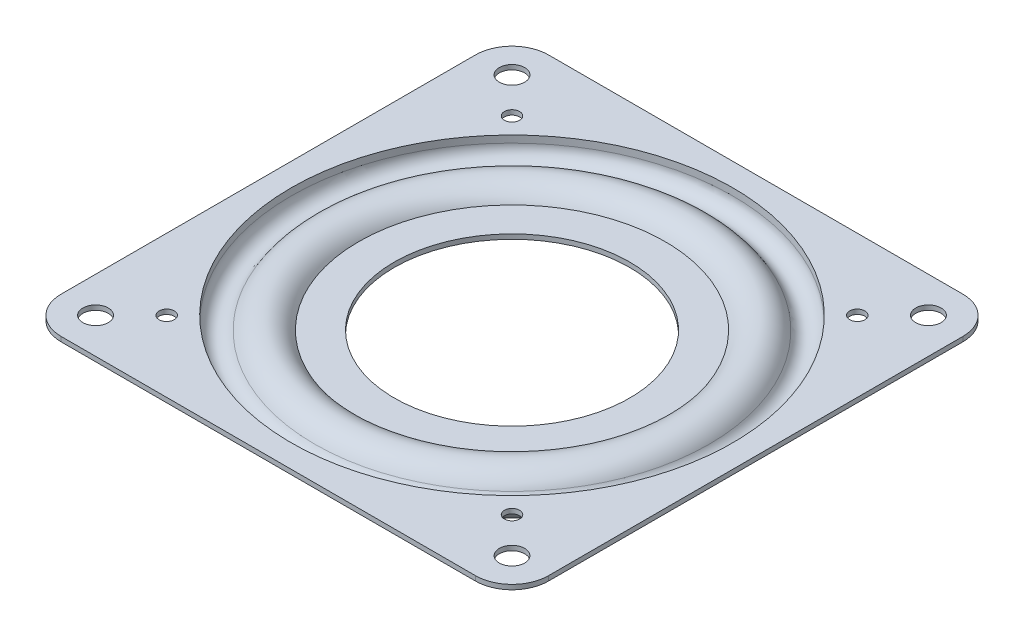
ISO-10303-21;
HEADER;
FILE_DESCRIPTION(('STEP AP214'),'2;1');
FILE_NAME('part.step','',(''),(''),'','','');
FILE_SCHEMA(('AUTOMOTIVE_DESIGN { 1 0 10303 214 1 1 1 1 }'));
ENDSEC;
DATA;
#1=APPLICATION_CONTEXT('core data for automotive mechanical design processes');
#2=APPLICATION_PROTOCOL_DEFINITION('international standard','automotive_design',2000,#1);
#3=PRODUCT_CONTEXT('',#1,'mechanical');
#4=PRODUCT('Part','Part','',(#3));
#5=PRODUCT_RELATED_PRODUCT_CATEGORY('part','',(#4));
#6=PRODUCT_DEFINITION_FORMATION('','',#4);
#7=PRODUCT_DEFINITION_CONTEXT('part definition',#1,'design');
#8=PRODUCT_DEFINITION('design','',#6,#7);
#9=PRODUCT_DEFINITION_SHAPE('','',#8);
#10=(LENGTH_UNIT() NAMED_UNIT(*) SI_UNIT(.MILLI.,.METRE.));
#11=(NAMED_UNIT(*) PLANE_ANGLE_UNIT() SI_UNIT($,.RADIAN.));
#12=(NAMED_UNIT(*) SI_UNIT($,.STERADIAN.) SOLID_ANGLE_UNIT());
#13=UNCERTAINTY_MEASURE_WITH_UNIT(LENGTH_MEASURE(1.E-05),#10,'distance_accuracy_value','');
#14=(GEOMETRIC_REPRESENTATION_CONTEXT(3) GLOBAL_UNCERTAINTY_ASSIGNED_CONTEXT((#13)) GLOBAL_UNIT_ASSIGNED_CONTEXT((#10,
#11,#12)) REPRESENTATION_CONTEXT('',''));
#15=CARTESIAN_POINT('',(0.,0.,0.));
#16=DIRECTION('',(0.,0.,1.));
#17=DIRECTION('',(1.,0.,0.));
#18=AXIS2_PLACEMENT_3D('',#15,#16,#17);
#19=CARTESIAN_POINT('',(26.2598834483685,0.,-7.7105974819143));
#20=DIRECTION('',(0.,1.,0.));
#21=DIRECTION('',(0.959492973614501,0.,-0.281732556841416));
#22=AXIS2_PLACEMENT_3D('',#19,#20,#21);
#23=SPHERICAL_SURFACE('',#22,3.68300000000001);
#24=CARTESIAN_POINT('',(26.2598834483685,3.68300000000001,-7.7105974819143));
#25=VERTEX_POINT('',#24);
#26=VERTEX_LOOP('',#25);
#27=FACE_BOUND('',#26,.T.);
#28=ADVANCED_FACE('F36',(#27),#23,.T.);
#29=CLOSED_SHELL('',(#28));
#30=MANIFOLD_SOLID_BREP('B2',#29);
#31=CARTESIAN_POINT('',(23.0238473132904,0.,-14.7965282125332));
#32=DIRECTION('',(0.,1.,0.));
#33=DIRECTION('',(0.841253532831189,0.,-0.540640817455586));
#34=AXIS2_PLACEMENT_3D('',#31,#32,#33);
#35=SPHERICAL_SURFACE('',#34,3.68300000000001);
#36=CARTESIAN_POINT('',(23.0238473132904,3.68300000000001,-14.7965282125332));
#37=VERTEX_POINT('',#36);
#38=VERTEX_LOOP('',#37);
#39=FACE_BOUND('',#38,.T.);
#40=ADVANCED_FACE('F55',(#39),#35,.T.);
#41=CLOSED_SHELL('',(#40));
#42=MANIFOLD_SOLID_BREP('B6',#41);
#43=CARTESIAN_POINT('',(17.9225559969818,0.,-20.6837322257143));
#44=DIRECTION('',(0.,1.,0.));
#45=DIRECTION('',(0.654860733945295,0.,-0.75574957435425));
#46=AXIS2_PLACEMENT_3D('',#43,#44,#45);
#47=SPHERICAL_SURFACE('',#46,3.68300000000001);
#48=CARTESIAN_POINT('',(17.9225559969818,3.68300000000001,-20.6837322257143));
#49=VERTEX_POINT('',#48);
#50=VERTEX_LOOP('',#49);
#51=FACE_BOUND('',#50,.T.);
#52=ADVANCED_FACE('F74',(#51),#47,.T.);
#53=CLOSED_SHELL('',(#52));
#54=MANIFOLD_SOLID_BREP('B32',#53);
#55=CARTESIAN_POINT('',(11.3692857833424,0.,-24.89526326486));
#56=DIRECTION('',(0.,1.,0.));
#57=DIRECTION('',(0.415415013001897,0.,-0.909631995354513));
#58=AXIS2_PLACEMENT_3D('',#55,#56,#57);
#59=SPHERICAL_SURFACE('',#58,3.68300000000001);
#60=CARTESIAN_POINT('',(11.3692857833424,3.68300000000001,-24.89526326486));
#61=VERTEX_POINT('',#60);
#62=VERTEX_LOOP('',#61);
#63=FACE_BOUND('',#62,.T.);
#64=ADVANCED_FACE('F93',(#63),#59,.T.);
#65=CLOSED_SHELL('',(#64));
#66=MANIFOLD_SOLID_BREP('B51',#65);
#67=CARTESIAN_POINT('',(3.89494365128271,0.,-27.0899281321183));
#68=DIRECTION('',(0.,1.,0.));
#69=DIRECTION('',(0.142314838273296,0.,-0.989821441880931));
#70=AXIS2_PLACEMENT_3D('',#67,#68,#69);
#71=SPHERICAL_SURFACE('',#70,3.68300000000001);
#72=CARTESIAN_POINT('',(3.89494365128271,3.683,-27.0899281321183));
#73=VERTEX_POINT('',#72);
#74=VERTEX_LOOP('',#73);
#75=FACE_BOUND('',#74,.T.);
#76=ADVANCED_FACE('F112',(#75),#71,.T.);
#77=CLOSED_SHELL('',(#76));
#78=MANIFOLD_SOLID_BREP('B70',#77);
#79=CARTESIAN_POINT('',(-3.89494365128212,0.,-27.0899281321183));
#80=DIRECTION('',(0.,1.,0.));
#81=DIRECTION('',(-0.142314838273275,0.,-0.989821441880934));
#82=AXIS2_PLACEMENT_3D('',#79,#80,#81);
#83=SPHERICAL_SURFACE('',#82,3.68300000000001);
#84=CARTESIAN_POINT('',(-3.89494365128212,3.683,-27.0899281321183));
#85=VERTEX_POINT('',#84);
#86=VERTEX_LOOP('',#85);
#87=FACE_BOUND('',#86,.T.);
#88=ADVANCED_FACE('F131',(#87),#83,.T.);
#89=CLOSED_SHELL('',(#88));
#90=MANIFOLD_SOLID_BREP('B89',#89);
#91=CARTESIAN_POINT('',(-11.3692857833419,0.,-24.8952632648602));
#92=DIRECTION('',(0.,1.,0.));
#93=DIRECTION('',(-0.415415013001877,0.,-0.909631995354522));
#94=AXIS2_PLACEMENT_3D('',#91,#92,#93);
#95=SPHERICAL_SURFACE('',#94,3.68300000000001);
#96=CARTESIAN_POINT('',(-11.3692857833419,3.683,-24.8952632648602));
#97=VERTEX_POINT('',#96);
#98=VERTEX_LOOP('',#97);
#99=FACE_BOUND('',#98,.T.);
#100=ADVANCED_FACE('F150',(#99),#95,.T.);
#101=CLOSED_SHELL('',(#100));
#102=MANIFOLD_SOLID_BREP('B108',#101);
#103=CARTESIAN_POINT('',(-17.9225559969813,0.,-20.6837322257147));
#104=DIRECTION('',(0.,1.,0.));
#105=DIRECTION('',(-0.654860733945278,0.,-0.755749574354264));
#106=AXIS2_PLACEMENT_3D('',#103,#104,#105);
#107=SPHERICAL_SURFACE('',#106,3.68300000000001);
#108=CARTESIAN_POINT('',(-17.9225559969814,3.683,-20.6837322257147));
#109=VERTEX_POINT('',#108);
#110=VERTEX_LOOP('',#109);
#111=FACE_BOUND('',#110,.T.);
#112=ADVANCED_FACE('F169',(#111),#107,.T.);
#113=CLOSED_SHELL('',(#112));
#114=MANIFOLD_SOLID_BREP('B127',#113);
#115=CARTESIAN_POINT('',(-23.0238473132901,0.,-14.7965282125337));
#116=DIRECTION('',(0.,1.,0.));
#117=DIRECTION('',(-0.841253532831177,0.,-0.540640817455605));
#118=AXIS2_PLACEMENT_3D('',#115,#116,#117);
#119=SPHERICAL_SURFACE('',#118,3.68300000000001);
#120=CARTESIAN_POINT('',(-23.0238473132901,3.68299999999999,-14.7965282125337));
#121=VERTEX_POINT('',#120);
#122=VERTEX_LOOP('',#121);
#123=FACE_BOUND('',#122,.T.);
#124=ADVANCED_FACE('F188',(#123),#119,.T.);
#125=CLOSED_SHELL('',(#124));
#126=MANIFOLD_SOLID_BREP('B146',#125);
#127=CARTESIAN_POINT('',(-26.2598834483683,0.,-7.71059748191487));
#128=DIRECTION('',(0.,1.,0.));
#129=DIRECTION('',(-0.959492973614495,0.,-0.281732556841437));
#130=AXIS2_PLACEMENT_3D('',#127,#128,#129);
#131=SPHERICAL_SURFACE('',#130,3.68300000000001);
#132=CARTESIAN_POINT('',(-26.2598834483683,3.68299999999999,-7.71059748191487));
#133=VERTEX_POINT('',#132);
#134=VERTEX_LOOP('',#133);
#135=FACE_BOUND('',#134,.T.);
#136=ADVANCED_FACE('F207',(#135),#131,.T.);
#137=CLOSED_SHELL('',(#136));
#138=MANIFOLD_SOLID_BREP('B165',#137);
#139=CARTESIAN_POINT('',(-27.3685,0.,0.));
#140=DIRECTION('',(0.,1.,0.));
#141=DIRECTION('',(-1.,0.,0.));
#142=AXIS2_PLACEMENT_3D('',#139,#140,#141);
#143=SPHERICAL_SURFACE('',#142,3.68300000000001);
#144=CARTESIAN_POINT('',(-27.3685,3.68299999999999,0.));
#145=VERTEX_POINT('',#144);
#146=VERTEX_LOOP('',#145);
#147=FACE_BOUND('',#146,.T.);
#148=ADVANCED_FACE('F226',(#147),#143,.T.);
#149=CLOSED_SHELL('',(#148));
#150=MANIFOLD_SOLID_BREP('B184',#149);
#151=CARTESIAN_POINT('',(-26.2598834483684,0.,7.71059748191449));
#152=DIRECTION('',(0.,1.,0.));
#153=DIRECTION('',(-0.959492973614499,0.,0.281732556841423));
#154=AXIS2_PLACEMENT_3D('',#151,#152,#153);
#155=SPHERICAL_SURFACE('',#154,3.68300000000001);
#156=CARTESIAN_POINT('',(-26.2598834483684,3.68299999999999,7.71059748191449));
#157=VERTEX_POINT('',#156);
#158=VERTEX_LOOP('',#157);
#159=FACE_BOUND('',#158,.T.);
#160=ADVANCED_FACE('F245',(#159),#155,.T.);
#161=CLOSED_SHELL('',(#160));
#162=MANIFOLD_SOLID_BREP('B203',#161);
#163=CARTESIAN_POINT('',(-23.0238473132903,0.,14.7965282125334));
#164=DIRECTION('',(0.,1.,0.));
#165=DIRECTION('',(-0.841253532831184,0.,0.540640817455593));
#166=AXIS2_PLACEMENT_3D('',#163,#164,#165);
#167=SPHERICAL_SURFACE('',#166,3.68300000000001);
#168=CARTESIAN_POINT('',(-23.0238473132903,3.68299999999999,14.7965282125334));
#169=VERTEX_POINT('',#168);
#170=VERTEX_LOOP('',#169);
#171=FACE_BOUND('',#170,.T.);
#172=ADVANCED_FACE('F264',(#171),#167,.T.);
#173=CLOSED_SHELL('',(#172));
#174=MANIFOLD_SOLID_BREP('B222',#173);
#175=CARTESIAN_POINT('',(-17.9225559969816,0.,20.6837322257144));
#176=DIRECTION('',(0.,1.,0.));
#177=DIRECTION('',(-0.654860733945289,0.,0.755749574354255));
#178=AXIS2_PLACEMENT_3D('',#175,#176,#177);
#179=SPHERICAL_SURFACE('',#178,3.68300000000001);
#180=CARTESIAN_POINT('',(-17.9225559969817,3.683,20.6837322257144));
#181=VERTEX_POINT('',#180);
#182=VERTEX_LOOP('',#181);
#183=FACE_BOUND('',#182,.T.);
#184=ADVANCED_FACE('F283',(#183),#179,.T.);
#185=CLOSED_SHELL('',(#184));
#186=MANIFOLD_SOLID_BREP('B241',#185);
#187=CARTESIAN_POINT('',(-11.3692857833422,0.,24.8952632648601));
#188=DIRECTION('',(0.,1.,0.));
#189=DIRECTION('',(-0.415415013001891,0.,0.909631995354516));
#190=AXIS2_PLACEMENT_3D('',#187,#188,#189);
#191=SPHERICAL_SURFACE('',#190,3.68300000000001);
#192=CARTESIAN_POINT('',(-11.3692857833422,3.683,24.8952632648601));
#193=VERTEX_POINT('',#192);
#194=VERTEX_LOOP('',#193);
#195=FACE_BOUND('',#194,.T.);
#196=ADVANCED_FACE('F302',(#195),#191,.T.);
#197=CLOSED_SHELL('',(#196));
#198=MANIFOLD_SOLID_BREP('B260',#197);
#199=CARTESIAN_POINT('',(-3.89494365128251,0.,27.0899281321183));
#200=DIRECTION('',(0.,1.,0.));
#201=DIRECTION('',(-0.142314838273289,0.,0.989821441880932));
#202=AXIS2_PLACEMENT_3D('',#199,#200,#201);
#203=SPHERICAL_SURFACE('',#202,3.68300000000001);
#204=CARTESIAN_POINT('',(-3.89494365128251,3.683,27.0899281321183));
#205=VERTEX_POINT('',#204);
#206=VERTEX_LOOP('',#205);
#207=FACE_BOUND('',#206,.T.);
#208=ADVANCED_FACE('F321',(#207),#203,.T.);
#209=CLOSED_SHELL('',(#208));
#210=MANIFOLD_SOLID_BREP('B279',#209);
#211=CARTESIAN_POINT('',(3.89494365128231,0.,27.0899281321183));
#212=DIRECTION('',(0.,1.,0.));
#213=DIRECTION('',(0.142314838273282,0.,0.989821441880933));
#214=AXIS2_PLACEMENT_3D('',#211,#212,#213);
#215=SPHERICAL_SURFACE('',#214,3.68300000000001);
#216=CARTESIAN_POINT('',(3.89494365128231,3.683,27.0899281321183));
#217=VERTEX_POINT('',#216);
#218=VERTEX_LOOP('',#217);
#219=FACE_BOUND('',#218,.T.);
#220=ADVANCED_FACE('F340',(#219),#215,.T.);
#221=CLOSED_SHELL('',(#220));
#222=MANIFOLD_SOLID_BREP('B298',#221);
#223=CARTESIAN_POINT('',(11.3692857833421,0.,24.8952632648602));
#224=DIRECTION('',(0.,1.,0.));
#225=DIRECTION('',(0.415415013001884,0.,0.909631995354519));
#226=AXIS2_PLACEMENT_3D('',#223,#224,#225);
#227=SPHERICAL_SURFACE('',#226,3.68300000000001);
#228=CARTESIAN_POINT('',(11.3692857833421,3.68300000000001,24.8952632648602));
#229=VERTEX_POINT('',#228);
#230=VERTEX_LOOP('',#229);
#231=FACE_BOUND('',#230,.T.);
#232=ADVANCED_FACE('F359',(#231),#227,.T.);
#233=CLOSED_SHELL('',(#232));
#234=MANIFOLD_SOLID_BREP('B317',#233);
#235=CARTESIAN_POINT('',(17.9225559969815,0.,20.6837322257146));
#236=DIRECTION('',(0.,1.,0.));
#237=DIRECTION('',(0.654860733945284,0.,0.75574957435426));
#238=AXIS2_PLACEMENT_3D('',#235,#236,#237);
#239=SPHERICAL_SURFACE('',#238,3.68300000000001);
#240=CARTESIAN_POINT('',(17.9225559969815,3.68300000000001,20.6837322257146));
#241=VERTEX_POINT('',#240);
#242=VERTEX_LOOP('',#241);
#243=FACE_BOUND('',#242,.T.);
#244=ADVANCED_FACE('F378',(#243),#239,.T.);
#245=CLOSED_SHELL('',(#244));
#246=MANIFOLD_SOLID_BREP('B336',#245);
#247=CARTESIAN_POINT('',(23.0238473132902,0.,14.7965282125336));
#248=DIRECTION('',(0.,1.,0.));
#249=DIRECTION('',(0.841253532831181,0.,0.540640817455599));
#250=AXIS2_PLACEMENT_3D('',#247,#248,#249);
#251=SPHERICAL_SURFACE('',#250,3.68300000000001);
#252=CARTESIAN_POINT('',(23.0238473132902,3.68300000000001,14.7965282125336));
#253=VERTEX_POINT('',#252);
#254=VERTEX_LOOP('',#253);
#255=FACE_BOUND('',#254,.T.);
#256=ADVANCED_FACE('F397',(#255),#251,.T.);
#257=CLOSED_SHELL('',(#256));
#258=MANIFOLD_SOLID_BREP('B355',#257);
#259=CARTESIAN_POINT('',(26.2598834483684,0.,7.71059748191469));
#260=DIRECTION('',(0.,1.,0.));
#261=DIRECTION('',(0.959492973614497,0.,0.28173255684143));
#262=AXIS2_PLACEMENT_3D('',#259,#260,#261);
#263=SPHERICAL_SURFACE('',#262,3.68300000000001);
#264=CARTESIAN_POINT('',(26.2598834483684,3.68300000000001,7.71059748191469));
#265=VERTEX_POINT('',#264);
#266=VERTEX_LOOP('',#265);
#267=FACE_BOUND('',#266,.T.);
#268=ADVANCED_FACE('F416',(#267),#263,.T.);
#269=CLOSED_SHELL('',(#268));
#270=MANIFOLD_SOLID_BREP('B374',#269);
#271=CARTESIAN_POINT('',(27.3685,0.,0.));
#272=DIRECTION('',(0.,1.,0.));
#273=DIRECTION('',(1.,0.,0.));
#274=AXIS2_PLACEMENT_3D('',#271,#272,#273);
#275=SPHERICAL_SURFACE('',#274,3.68300000000001);
#276=CARTESIAN_POINT('',(27.3685,3.68300000000001,0.));
#277=VERTEX_POINT('',#276);
#278=VERTEX_LOOP('',#277);
#279=FACE_BOUND('',#278,.T.);
#280=ADVANCED_FACE('F438',(#279),#275,.T.);
#281=CLOSED_SHELL('',(#280));
#282=MANIFOLD_SOLID_BREP('B393',#281);
#283=CARTESIAN_POINT('',(23.9429787423809,1.94055999999999,0.));
#284=DIRECTION('',(0.,-1.,0.));
#285=DIRECTION('',(1.,0.,0.));
#286=AXIS2_PLACEMENT_3D('',#283,#284,#285);
#287=PLANE('',#286);
#288=CARTESIAN_POINT('',(0.,1.94055999999999,0.));
#289=DIRECTION('',(0.,1.,0.));
#290=DIRECTION('',(-1.,0.,0.));
#291=AXIS2_PLACEMENT_3D('',#288,#289,#290);
#292=CIRCLE('',#291,18.40865);
#293=CARTESIAN_POINT('',(-18.40865,1.94055999999998,0.));
#294=VERTEX_POINT('',#293);
#295=EDGE_CURVE('E527',#294,#294,#292,.T.);
#296=ORIENTED_EDGE('',*,*,#295,.F.);
#297=EDGE_LOOP('',(#296));
#298=FACE_BOUND('',#297,.T.);
#299=CARTESIAN_POINT('',(0.,1.94055999999999,0.));
#300=DIRECTION('',(0.,1.,0.));
#301=DIRECTION('',(-1.,0.,0.));
#302=AXIS2_PLACEMENT_3D('',#299,#300,#301);
#303=CIRCLE('',#302,23.9429787423809);
#304=CARTESIAN_POINT('',(-23.9429787423809,1.94055999999998,0.));
#305=VERTEX_POINT('',#304);
#306=EDGE_CURVE('E533',#305,#305,#303,.T.);
#307=ORIENTED_EDGE('',*,*,#306,.T.);
#308=EDGE_LOOP('',(#307));
#309=FACE_BOUND('',#308,.T.);
#310=ADVANCED_FACE('F451',(#298,#309),#287,.F.);
#311=CARTESIAN_POINT('',(0.,3.93699999999999,0.));
#312=DIRECTION('',(0.,1.,0.));
#313=DIRECTION('',(-1.,0.,0.));
#314=AXIS2_PLACEMENT_3D('',#311,#312,#313);
#315=CYLINDRICAL_SURFACE('',#314,18.40865);
#316=ORIENTED_EDGE('',*,*,#295,.T.);
#317=EDGE_LOOP('',(#316));
#318=FACE_BOUND('',#317,.T.);
#319=CARTESIAN_POINT('',(0.,1.20395999999999,0.));
#320=DIRECTION('',(0.,1.,0.));
#321=DIRECTION('',(-1.,0.,0.));
#322=AXIS2_PLACEMENT_3D('',#319,#320,#321);
#323=CIRCLE('',#322,18.40865);
#324=CARTESIAN_POINT('',(-18.40865,1.20395999999998,0.));
#325=VERTEX_POINT('',#324);
#326=EDGE_CURVE('E599',#325,#325,#323,.T.);
#327=ORIENTED_EDGE('',*,*,#326,.F.);
#328=EDGE_LOOP('',(#327));
#329=FACE_BOUND('',#328,.T.);
#330=ADVANCED_FACE('F623',(#318,#329),#315,.F.);
#331=CARTESIAN_POINT('',(23.9429787423809,1.20395999999999,0.));
#332=DIRECTION('',(0.,-1.,0.));
#333=DIRECTION('',(1.,0.,0.));
#334=AXIS2_PLACEMENT_3D('',#331,#332,#333);
#335=PLANE('',#334);
#336=ORIENTED_EDGE('',*,*,#326,.T.);
#337=EDGE_LOOP('',(#336));
#338=FACE_BOUND('',#337,.T.);
#339=CARTESIAN_POINT('',(0.,1.20395999999999,0.));
#340=DIRECTION('',(0.,1.,0.));
#341=DIRECTION('',(-1.,0.,0.));
#342=AXIS2_PLACEMENT_3D('',#339,#340,#341);
#343=CIRCLE('',#342,24.4031938643034);
#344=CARTESIAN_POINT('',(-24.4031938643034,1.20395999999998,0.));
#345=VERTEX_POINT('',#344);
#346=EDGE_CURVE('E596',#345,#345,#343,.T.);
#347=ORIENTED_EDGE('',*,*,#346,.F.);
#348=EDGE_LOOP('',(#347));
#349=FACE_BOUND('',#348,.T.);
#350=ADVANCED_FACE('F629',(#338,#349),#335,.T.);
#351=CARTESIAN_POINT('',(0.,0.,0.));
#352=DIRECTION('',(0.,1.,0.));
#353=DIRECTION('',(-1.,0.,0.));
#354=AXIS2_PLACEMENT_3D('',#351,#352,#353);
#355=TOROIDAL_SURFACE('',#354,27.3685,3.20040000000001);
#356=ORIENTED_EDGE('',*,*,#346,.T.);
#357=EDGE_LOOP('',(#356));
#358=FACE_BOUND('',#357,.T.);
#359=CARTESIAN_POINT('',(0.,1.53619200000001,0.));
#360=DIRECTION('',(0.,1.,0.));
#361=DIRECTION('',(-1.,0.,0.));
#362=AXIS2_PLACEMENT_3D('',#359,#360,#361);
#363=CIRCLE('',#362,30.1761100689262);
#364=CARTESIAN_POINT('',(-30.1761100689262,1.536192,0.));
#365=VERTEX_POINT('',#364);
#366=EDGE_CURVE('E593',#365,#365,#363,.T.);
#367=ORIENTED_EDGE('',*,*,#366,.F.);
#368=EDGE_LOOP('',(#367));
#369=FACE_BOUND('',#368,.T.);
#370=ADVANCED_FACE('F845',(#358,#369),#355,.F.);
#371=CARTESIAN_POINT('',(0.,2.83464000000002,0.));
#372=DIRECTION('',(0.,1.,0.));
#373=DIRECTION('',(-1.,0.,0.));
#374=AXIS2_PLACEMENT_3D('',#371,#372,#373);
#375=TOROIDAL_SURFACE('',#374,32.5492090557567,2.70510000000001);
#376=ORIENTED_EDGE('',*,*,#366,.T.);
#377=EDGE_LOOP('',(#376));
#378=FACE_BOUND('',#377,.T.);
#379=CARTESIAN_POINT('',(0.,2.83464000000002,0.));
#380=DIRECTION('',(0.,1.,0.));
#381=DIRECTION('',(-1.,0.,0.));
#382=AXIS2_PLACEMENT_3D('',#379,#380,#381);
#383=CIRCLE('',#382,35.2543090557567);
#384=CARTESIAN_POINT('',(-35.2543090557567,2.83464000000001,0.));
#385=VERTEX_POINT('',#384);
#386=EDGE_CURVE('E590',#385,#385,#383,.T.);
#387=ORIENTED_EDGE('',*,*,#386,.F.);
#388=EDGE_LOOP('',(#387));
#389=FACE_BOUND('',#388,.T.);
#390=ADVANCED_FACE('F838',(#378,#389),#375,.T.);
#391=CARTESIAN_POINT('',(0.,3.93699999999999,0.));
#392=DIRECTION('',(0.,1.,0.));
#393=DIRECTION('',(-1.,0.,0.));
#394=AXIS2_PLACEMENT_3D('',#391,#392,#393);
#395=CYLINDRICAL_SURFACE('',#394,35.2543090557567);
#396=ORIENTED_EDGE('',*,*,#386,.T.);
#397=EDGE_LOOP('',(#396));
#398=FACE_BOUND('',#397,.T.);
#399=CARTESIAN_POINT('',(0.,3.20039999999999,0.));
#400=DIRECTION('',(0.,1.,0.));
#401=DIRECTION('',(-1.,0.,0.));
#402=AXIS2_PLACEMENT_3D('',#399,#400,#401);
#403=CIRCLE('',#402,35.2543090557567);
#404=CARTESIAN_POINT('',(-35.2543090557567,3.20039999999998,0.));
#405=VERTEX_POINT('',#404);
#406=EDGE_CURVE('E587',#405,#405,#403,.T.);
#407=ORIENTED_EDGE('',*,*,#406,.F.);
#408=EDGE_LOOP('',(#407));
#409=FACE_BOUND('',#408,.T.);
#410=ADVANCED_FACE('F788',(#398,#409),#395,.T.);
#411=CARTESIAN_POINT('',(38.1,3.2004,0.));
#412=DIRECTION('',(0.,-1.,0.));
#413=DIRECTION('',(1.,0.,0.));
#414=AXIS2_PLACEMENT_3D('',#411,#412,#413);
#415=PLANE('',#414);
#416=CARTESIAN_POINT('',(-32.54375,3.20039999999998,32.54375));
#417=DIRECTION('',(0.,-1.,0.));
#418=DIRECTION('',(1.,0.,0.));
#419=AXIS2_PLACEMENT_3D('',#416,#417,#418);
#420=CIRCLE('',#419,1.98437499999999);
#421=CARTESIAN_POINT('',(-30.559375,3.20039999999998,32.54375));
#422=VERTEX_POINT('',#421);
#423=EDGE_CURVE('E571',#422,#422,#420,.F.);
#424=ORIENTED_EDGE('',*,*,#423,.T.);
#425=EDGE_LOOP('',(#424));
#426=FACE_BOUND('',#425,.T.);
#427=CARTESIAN_POINT('',(32.54375,3.2004,32.54375));
#428=DIRECTION('',(0.,-1.,0.));
#429=DIRECTION('',(1.,0.,0.));
#430=AXIS2_PLACEMENT_3D('',#427,#428,#429);
#431=CIRCLE('',#430,1.984375);
#432=CARTESIAN_POINT('',(34.528125,3.2004,32.54375));
#433=VERTEX_POINT('',#432);
#434=EDGE_CURVE('E905',#433,#433,#431,.F.);
#435=ORIENTED_EDGE('',*,*,#434,.T.);
#436=EDGE_LOOP('',(#435));
#437=FACE_BOUND('',#436,.T.);
#438=CARTESIAN_POINT('',(32.54375,3.2004,-32.54375));
#439=DIRECTION('',(0.,-1.,0.));
#440=DIRECTION('',(1.,0.,0.));
#441=AXIS2_PLACEMENT_3D('',#438,#439,#440);
#442=CIRCLE('',#441,1.984375);
#443=CARTESIAN_POINT('',(34.528125,3.2004,-32.54375));
#444=VERTEX_POINT('',#443);
#445=EDGE_CURVE('E909',#444,#444,#442,.F.);
#446=ORIENTED_EDGE('',*,*,#445,.T.);
#447=EDGE_LOOP('',(#446));
#448=FACE_BOUND('',#447,.T.);
#449=CARTESIAN_POINT('',(26.9875,3.2004,-26.9875));
#450=DIRECTION('',(0.,-1.,0.));
#451=DIRECTION('',(1.,0.,0.));
#452=AXIS2_PLACEMENT_3D('',#449,#450,#451);
#453=CIRCLE('',#452,1.190625);
#454=CARTESIAN_POINT('',(28.178125,3.2004,-26.9875));
#455=VERTEX_POINT('',#454);
#456=EDGE_CURVE('E913',#455,#455,#453,.F.);
#457=ORIENTED_EDGE('',*,*,#456,.T.);
#458=EDGE_LOOP('',(#457));
#459=FACE_BOUND('',#458,.T.);
#460=CARTESIAN_POINT('',(-26.9875,3.20039999999998,26.9875));
#461=DIRECTION('',(0.,-1.,0.));
#462=DIRECTION('',(1.,0.,0.));
#463=AXIS2_PLACEMENT_3D('',#460,#461,#462);
#464=CIRCLE('',#463,1.190625);
#465=CARTESIAN_POINT('',(-25.796875,3.20039999999998,26.9875));
#466=VERTEX_POINT('',#465);
#467=EDGE_CURVE('E917',#466,#466,#464,.F.);
#468=ORIENTED_EDGE('',*,*,#467,.T.);
#469=EDGE_LOOP('',(#468));
#470=FACE_BOUND('',#469,.T.);
#471=CARTESIAN_POINT('',(26.9875,3.2004,26.9875));
#472=DIRECTION('',(0.,-1.,0.));
#473=DIRECTION('',(1.,0.,0.));
#474=AXIS2_PLACEMENT_3D('',#471,#472,#473);
#475=CIRCLE('',#474,1.190625);
#476=CARTESIAN_POINT('',(28.178125,3.2004,26.9875));
#477=VERTEX_POINT('',#476);
#478=EDGE_CURVE('E921',#477,#477,#475,.F.);
#479=ORIENTED_EDGE('',*,*,#478,.T.);
#480=EDGE_LOOP('',(#479));
#481=FACE_BOUND('',#480,.T.);
#482=CARTESIAN_POINT('',(-26.9875,3.20039999999998,-26.9875));
#483=DIRECTION('',(0.,-1.,0.));
#484=DIRECTION('',(1.,0.,0.));
#485=AXIS2_PLACEMENT_3D('',#482,#483,#484);
#486=CIRCLE('',#485,1.190625);
#487=CARTESIAN_POINT('',(-25.796875,3.20039999999998,-26.9875));
#488=VERTEX_POINT('',#487);
#489=EDGE_CURVE('E925',#488,#488,#486,.F.);
#490=ORIENTED_EDGE('',*,*,#489,.T.);
#491=EDGE_LOOP('',(#490));
#492=FACE_BOUND('',#491,.T.);
#493=CARTESIAN_POINT('',(-32.54375,3.20039999999998,-32.54375));
#494=DIRECTION('',(0.,-1.,0.));
#495=DIRECTION('',(1.,0.,0.));
#496=AXIS2_PLACEMENT_3D('',#493,#494,#495);
#497=CIRCLE('',#496,1.98437499999999);
#498=CARTESIAN_POINT('',(-30.559375,3.20039999999998,-32.54375));
#499=VERTEX_POINT('',#498);
#500=EDGE_CURVE('E928',#499,#499,#497,.F.);
#501=ORIENTED_EDGE('',*,*,#500,.T.);
#502=EDGE_LOOP('',(#501));
#503=FACE_BOUND('',#502,.T.);
#504=ORIENTED_EDGE('',*,*,#406,.T.);
#505=EDGE_LOOP('',(#504));
#506=FACE_BOUND('',#505,.T.);
#507=DIRECTION('',(0.,0.,1.));
#508=VECTOR('',#507,1.);
#509=CARTESIAN_POINT('',(-38.1,3.20039999999997,-38.1));
#510=LINE('',#509,#508);
#511=CARTESIAN_POINT('',(-38.1,3.20039999999997,-32.385));
#512=VERTEX_POINT('',#511);
#513=CARTESIAN_POINT('',(-38.1,3.20039999999997,32.385));
#514=VERTEX_POINT('',#513);
#515=EDGE_CURVE('E575',#512,#514,#510,.T.);
#516=ORIENTED_EDGE('',*,*,#515,.F.);
#517=CARTESIAN_POINT('',(-32.385,3.20039999999998,-32.385));
#518=DIRECTION('',(0.,-1.,0.));
#519=DIRECTION('',(1.,0.,0.));
#520=AXIS2_PLACEMENT_3D('',#517,#518,#519);
#521=CIRCLE('',#520,5.715);
#522=CARTESIAN_POINT('',(-32.385,3.20039999999998,-38.1));
#523=VERTEX_POINT('',#522);
#524=EDGE_CURVE('E532',#512,#523,#521,.T.);
#525=ORIENTED_EDGE('',*,*,#524,.T.);
#526=DIRECTION('',(-1.,0.,0.));
#527=VECTOR('',#526,1.);
#528=CARTESIAN_POINT('',(-38.1,3.20039999999997,-38.1));
#529=LINE('',#528,#527);
#530=CARTESIAN_POINT('',(32.385,3.2004,-38.1));
#531=VERTEX_POINT('',#530);
#532=EDGE_CURVE('E521',#531,#523,#529,.T.);
#533=ORIENTED_EDGE('',*,*,#532,.F.);
#534=CARTESIAN_POINT('',(32.385,3.2004,-32.385));
#535=DIRECTION('',(0.,-1.,0.));
#536=DIRECTION('',(1.,0.,0.));
#537=AXIS2_PLACEMENT_3D('',#534,#535,#536);
#538=CIRCLE('',#537,5.715);
#539=CARTESIAN_POINT('',(38.1,3.2004,-32.385));
#540=VERTEX_POINT('',#539);
#541=EDGE_CURVE('E466',#531,#540,#538,.T.);
#542=ORIENTED_EDGE('',*,*,#541,.T.);
#543=DIRECTION('',(0.,0.,-1.));
#544=VECTOR('',#543,1.);
#545=CARTESIAN_POINT('',(38.1,3.2004,-38.1));
#546=LINE('',#545,#544);
#547=CARTESIAN_POINT('',(38.1,3.2004,32.385));
#548=VERTEX_POINT('',#547);
#549=EDGE_CURVE('E534',#548,#540,#546,.T.);
#550=ORIENTED_EDGE('',*,*,#549,.F.);
#551=CARTESIAN_POINT('',(32.385,3.2004,32.385));
#552=DIRECTION('',(0.,-1.,0.));
#553=DIRECTION('',(1.,0.,0.));
#554=AXIS2_PLACEMENT_3D('',#551,#552,#553);
#555=CIRCLE('',#554,5.715);
#556=CARTESIAN_POINT('',(32.385,3.2004,38.1));
#557=VERTEX_POINT('',#556);
#558=EDGE_CURVE('E543',#548,#557,#555,.T.);
#559=ORIENTED_EDGE('',*,*,#558,.T.);
#560=DIRECTION('',(1.,0.,0.));
#561=VECTOR('',#560,1.);
#562=CARTESIAN_POINT('',(-38.1,3.20039999999997,38.1));
#563=LINE('',#562,#561);
#564=CARTESIAN_POINT('',(-32.385,3.20039999999998,38.1));
#565=VERTEX_POINT('',#564);
#566=EDGE_CURVE('E558',#565,#557,#563,.T.);
#567=ORIENTED_EDGE('',*,*,#566,.F.);
#568=CARTESIAN_POINT('',(-32.385,3.20039999999998,32.385));
#569=DIRECTION('',(0.,-1.,0.));
#570=DIRECTION('',(1.,0.,0.));
#571=AXIS2_PLACEMENT_3D('',#568,#569,#570);
#572=CIRCLE('',#571,5.715);
#573=EDGE_CURVE('E540',#565,#514,#572,.T.);
#574=ORIENTED_EDGE('',*,*,#573,.T.);
#575=EDGE_LOOP('',(#516,#525,#533,#542,#550,#559,#567,#574));
#576=FACE_BOUND('',#575,.T.);
#577=ADVANCED_FACE('F530',(#426,#437,#448,#459,#470,#481,#492,#503,#506,#576),#415,.T.);
#578=CARTESIAN_POINT('',(38.1,3.937,0.));
#579=DIRECTION('',(0.,-1.,0.));
#580=DIRECTION('',(1.,0.,0.));
#581=AXIS2_PLACEMENT_3D('',#578,#579,#580);
#582=PLANE('',#581);
#583=CARTESIAN_POINT('',(-32.54375,3.937,32.54375));
#584=DIRECTION('',(0.,1.,0.));
#585=DIRECTION('',(0.,0.,1.));
#586=AXIS2_PLACEMENT_3D('',#583,#584,#585);
#587=CIRCLE('',#586,1.98437499999999);
#588=CARTESIAN_POINT('',(-32.54375,3.937,34.528125));
#589=VERTEX_POINT('',#588);
#590=EDGE_CURVE('E933',#589,#589,#587,.T.);
#591=ORIENTED_EDGE('',*,*,#590,.F.);
#592=EDGE_LOOP('',(#591));
#593=FACE_BOUND('',#592,.T.);
#594=CARTESIAN_POINT('',(32.54375,3.937,32.54375));
#595=DIRECTION('',(0.,1.,0.));
#596=DIRECTION('',(0.,0.,1.));
#597=AXIS2_PLACEMENT_3D('',#594,#595,#596);
#598=CIRCLE('',#597,1.984375);
#599=CARTESIAN_POINT('',(32.54375,3.937,34.528125));
#600=VERTEX_POINT('',#599);
#601=EDGE_CURVE('E956',#600,#600,#598,.T.);
#602=ORIENTED_EDGE('',*,*,#601,.F.);
#603=EDGE_LOOP('',(#602));
#604=FACE_BOUND('',#603,.T.);
#605=CARTESIAN_POINT('',(32.54375,3.937,-32.54375));
#606=DIRECTION('',(0.,1.,0.));
#607=DIRECTION('',(0.,0.,1.));
#608=AXIS2_PLACEMENT_3D('',#605,#606,#607);
#609=CIRCLE('',#608,1.984375);
#610=CARTESIAN_POINT('',(32.54375,3.937,-30.559375));
#611=VERTEX_POINT('',#610);
#612=EDGE_CURVE('E952',#611,#611,#609,.T.);
#613=ORIENTED_EDGE('',*,*,#612,.F.);
#614=EDGE_LOOP('',(#613));
#615=FACE_BOUND('',#614,.T.);
#616=CARTESIAN_POINT('',(26.9875,3.937,-26.9875));
#617=DIRECTION('',(0.,1.,0.));
#618=DIRECTION('',(0.,0.,1.));
#619=AXIS2_PLACEMENT_3D('',#616,#617,#618);
#620=CIRCLE('',#619,1.190625);
#621=CARTESIAN_POINT('',(26.9875,3.937,-25.796875));
#622=VERTEX_POINT('',#621);
#623=EDGE_CURVE('E949',#622,#622,#620,.T.);
#624=ORIENTED_EDGE('',*,*,#623,.F.);
#625=EDGE_LOOP('',(#624));
#626=FACE_BOUND('',#625,.T.);
#627=CARTESIAN_POINT('',(-26.9875,3.937,26.9875));
#628=DIRECTION('',(0.,1.,0.));
#629=DIRECTION('',(0.,0.,1.));
#630=AXIS2_PLACEMENT_3D('',#627,#628,#629);
#631=CIRCLE('',#630,1.190625);
#632=CARTESIAN_POINT('',(-26.9875,3.937,28.178125));
#633=VERTEX_POINT('',#632);
#634=EDGE_CURVE('E964',#633,#633,#631,.T.);
#635=ORIENTED_EDGE('',*,*,#634,.F.);
#636=EDGE_LOOP('',(#635));
#637=FACE_BOUND('',#636,.T.);
#638=CARTESIAN_POINT('',(26.9875,3.937,26.9875));
#639=DIRECTION('',(0.,1.,0.));
#640=DIRECTION('',(0.,0.,1.));
#641=AXIS2_PLACEMENT_3D('',#638,#639,#640);
#642=CIRCLE('',#641,1.190625);
#643=CARTESIAN_POINT('',(26.9875,3.937,28.178125));
#644=VERTEX_POINT('',#643);
#645=EDGE_CURVE('E961',#644,#644,#642,.T.);
#646=ORIENTED_EDGE('',*,*,#645,.F.);
#647=EDGE_LOOP('',(#646));
#648=FACE_BOUND('',#647,.T.);
#649=CARTESIAN_POINT('',(-26.9875,3.937,-26.9875));
#650=DIRECTION('',(0.,1.,0.));
#651=DIRECTION('',(0.,0.,1.));
#652=AXIS2_PLACEMENT_3D('',#649,#650,#651);
#653=CIRCLE('',#652,1.190625);
#654=CARTESIAN_POINT('',(-26.9875,3.937,-25.796875));
#655=VERTEX_POINT('',#654);
#656=EDGE_CURVE('E953',#655,#655,#653,.T.);
#657=ORIENTED_EDGE('',*,*,#656,.F.);
#658=EDGE_LOOP('',(#657));
#659=FACE_BOUND('',#658,.T.);
#660=CARTESIAN_POINT('',(-32.54375,3.937,-32.54375));
#661=DIRECTION('',(0.,1.,0.));
#662=DIRECTION('',(0.,0.,1.));
#663=AXIS2_PLACEMENT_3D('',#660,#661,#662);
#664=CIRCLE('',#663,1.98437499999999);
#665=CARTESIAN_POINT('',(-32.54375,3.937,-30.559375));
#666=VERTEX_POINT('',#665);
#667=EDGE_CURVE('E929',#666,#666,#664,.T.);
#668=ORIENTED_EDGE('',*,*,#667,.F.);
#669=EDGE_LOOP('',(#668));
#670=FACE_BOUND('',#669,.T.);
#671=CARTESIAN_POINT('',(0.,3.937,0.));
#672=DIRECTION('',(0.,1.,0.));
#673=DIRECTION('',(-1.,0.,0.));
#674=AXIS2_PLACEMENT_3D('',#671,#672,#673);
#675=CIRCLE('',#674,34.5177090557568);
#676=CARTESIAN_POINT('',(-34.5177090557568,3.93699999999999,0.));
#677=VERTEX_POINT('',#676);
#678=EDGE_CURVE('E584',#677,#677,#675,.T.);
#679=ORIENTED_EDGE('',*,*,#678,.F.);
#680=EDGE_LOOP('',(#679));
#681=FACE_BOUND('',#680,.T.);
#682=DIRECTION('',(-1.,0.,0.));
#683=VECTOR('',#682,1.);
#684=CARTESIAN_POINT('',(-38.1,3.93699999999998,-38.1));
#685=LINE('',#684,#683);
#686=CARTESIAN_POINT('',(32.385,3.937,-38.1));
#687=VERTEX_POINT('',#686);
#688=CARTESIAN_POINT('',(-32.385,3.93699999999998,-38.1));
#689=VERTEX_POINT('',#688);
#690=EDGE_CURVE('E524',#687,#689,#685,.T.);
#691=ORIENTED_EDGE('',*,*,#690,.T.);
#692=CARTESIAN_POINT('',(-32.385,3.93699999999998,-32.385));
#693=DIRECTION('',(0.,-1.,0.));
#694=DIRECTION('',(1.,0.,0.));
#695=AXIS2_PLACEMENT_3D('',#692,#693,#694);
#696=CIRCLE('',#695,5.715);
#697=CARTESIAN_POINT('',(-38.1,3.93699999999998,-32.385));
#698=VERTEX_POINT('',#697);
#699=EDGE_CURVE('E609',#689,#698,#696,.F.);
#700=ORIENTED_EDGE('',*,*,#699,.T.);
#701=DIRECTION('',(0.,0.,1.));
#702=VECTOR('',#701,1.);
#703=CARTESIAN_POINT('',(-38.1,3.93699999999998,-38.1));
#704=LINE('',#703,#702);
#705=CARTESIAN_POINT('',(-38.1,3.93699999999998,32.385));
#706=VERTEX_POINT('',#705);
#707=EDGE_CURVE('E568',#698,#706,#704,.T.);
#708=ORIENTED_EDGE('',*,*,#707,.T.);
#709=CARTESIAN_POINT('',(-32.385,3.93699999999998,32.385));
#710=DIRECTION('',(0.,-1.,0.));
#711=DIRECTION('',(1.,0.,0.));
#712=AXIS2_PLACEMENT_3D('',#709,#710,#711);
#713=CIRCLE('',#712,5.715);
#714=CARTESIAN_POINT('',(-32.385,3.93699999999998,38.1));
#715=VERTEX_POINT('',#714);
#716=EDGE_CURVE('E566',#706,#715,#713,.F.);
#717=ORIENTED_EDGE('',*,*,#716,.T.);
#718=DIRECTION('',(1.,0.,0.));
#719=VECTOR('',#718,1.);
#720=CARTESIAN_POINT('',(-38.1,3.93699999999998,38.1));
#721=LINE('',#720,#719);
#722=CARTESIAN_POINT('',(32.385,3.937,38.1));
#723=VERTEX_POINT('',#722);
#724=EDGE_CURVE('E555',#715,#723,#721,.T.);
#725=ORIENTED_EDGE('',*,*,#724,.T.);
#726=CARTESIAN_POINT('',(32.385,3.937,32.385));
#727=DIRECTION('',(0.,-1.,0.));
#728=DIRECTION('',(1.,0.,0.));
#729=AXIS2_PLACEMENT_3D('',#726,#727,#728);
#730=CIRCLE('',#729,5.715);
#731=CARTESIAN_POINT('',(38.1,3.937,32.385));
#732=VERTEX_POINT('',#731);
#733=EDGE_CURVE('E564',#723,#732,#730,.F.);
#734=ORIENTED_EDGE('',*,*,#733,.T.);
#735=DIRECTION('',(0.,0.,-1.));
#736=VECTOR('',#735,1.);
#737=CARTESIAN_POINT('',(38.1,3.937,-38.1));
#738=LINE('',#737,#736);
#739=CARTESIAN_POINT('',(38.1,3.937,-32.385));
#740=VERTEX_POINT('',#739);
#741=EDGE_CURVE('E567',#732,#740,#738,.T.);
#742=ORIENTED_EDGE('',*,*,#741,.T.);
#743=CARTESIAN_POINT('',(32.385,3.937,-32.385));
#744=DIRECTION('',(0.,-1.,0.));
#745=DIRECTION('',(1.,0.,0.));
#746=AXIS2_PLACEMENT_3D('',#743,#744,#745);
#747=CIRCLE('',#746,5.715);
#748=EDGE_CURVE('E607',#740,#687,#747,.F.);
#749=ORIENTED_EDGE('',*,*,#748,.T.);
#750=EDGE_LOOP('',(#691,#700,#708,#717,#725,#734,#742,#749));
#751=FACE_BOUND('',#750,.T.);
#752=ADVANCED_FACE('F562',(#593,#604,#615,#626,#637,#648,#659,#670,#681,#751),#582,.F.);
#753=CARTESIAN_POINT('',(0.,3.93699999999999,0.));
#754=DIRECTION('',(0.,1.,0.));
#755=DIRECTION('',(-1.,0.,0.));
#756=AXIS2_PLACEMENT_3D('',#753,#754,#755);
#757=CYLINDRICAL_SURFACE('',#756,34.5177090557568);
#758=ORIENTED_EDGE('',*,*,#678,.T.);
#759=EDGE_LOOP('',(#758));
#760=FACE_BOUND('',#759,.T.);
#761=CARTESIAN_POINT('',(0.,2.83464000000002,0.));
#762=DIRECTION('',(0.,1.,0.));
#763=DIRECTION('',(-1.,0.,0.));
#764=AXIS2_PLACEMENT_3D('',#761,#762,#763);
#765=CIRCLE('',#764,34.5177090557568);
#766=CARTESIAN_POINT('',(-34.5177090557568,2.83464000000001,0.));
#767=VERTEX_POINT('',#766);
#768=EDGE_CURVE('E581',#767,#767,#765,.T.);
#769=ORIENTED_EDGE('',*,*,#768,.F.);
#770=EDGE_LOOP('',(#769));
#771=FACE_BOUND('',#770,.T.);
#772=ADVANCED_FACE('F776',(#760,#771),#757,.F.);
#773=CARTESIAN_POINT('',(0.,2.83464000000002,0.));
#774=DIRECTION('',(0.,1.,0.));
#775=DIRECTION('',(-1.,0.,0.));
#776=AXIS2_PLACEMENT_3D('',#773,#774,#775);
#777=TOROIDAL_SURFACE('',#776,32.5492090557567,1.96850000000001);
#778=CARTESIAN_POINT('',(0.,1.88976000000001,0.));
#779=DIRECTION('',(0.,1.,0.));
#780=DIRECTION('',(-1.,0.,0.));
#781=AXIS2_PLACEMENT_3D('',#778,#779,#780);
#782=CIRCLE('',#781,30.8223060371712);
#783=CARTESIAN_POINT('',(-30.8223060371712,1.88976,0.));
#784=VERTEX_POINT('',#783);
#785=EDGE_CURVE('E578',#784,#784,#782,.T.);
#786=ORIENTED_EDGE('',*,*,#785,.F.);
#787=EDGE_LOOP('',(#786));
#788=FACE_BOUND('',#787,.T.);
#789=ORIENTED_EDGE('',*,*,#768,.T.);
#790=EDGE_LOOP('',(#789));
#791=FACE_BOUND('',#790,.T.);
#792=ADVANCED_FACE('F800',(#788,#791),#777,.F.);
#793=CARTESIAN_POINT('',(0.,0.,0.));
#794=DIRECTION('',(0.,1.,0.));
#795=DIRECTION('',(-1.,0.,0.));
#796=AXIS2_PLACEMENT_3D('',#793,#794,#795);
#797=TOROIDAL_SURFACE('',#796,27.3685,3.93700000000001);
#798=ORIENTED_EDGE('',*,*,#306,.F.);
#799=EDGE_LOOP('',(#798));
#800=FACE_BOUND('',#799,.T.);
#801=ORIENTED_EDGE('',*,*,#785,.T.);
#802=EDGE_LOOP('',(#801));
#803=FACE_BOUND('',#802,.T.);
#804=ADVANCED_FACE('F766',(#800,#803),#797,.T.);
#805=CARTESIAN_POINT('',(-38.1,3.20039999999997,-38.1));
#806=DIRECTION('',(-1.,0.,0.));
#807=DIRECTION('',(0.,-1.,0.));
#808=AXIS2_PLACEMENT_3D('',#805,#806,#807);
#809=PLANE('',#808);
#810=ORIENTED_EDGE('',*,*,#707,.F.);
#811=DIRECTION('',(0.,1.,0.));
#812=VECTOR('',#811,1.);
#813=CARTESIAN_POINT('',(-38.1,3.20039999999997,-32.385));
#814=LINE('',#813,#812);
#815=EDGE_CURVE('E614',#698,#512,#814,.F.);
#816=ORIENTED_EDGE('',*,*,#815,.T.);
#817=ORIENTED_EDGE('',*,*,#515,.T.);
#818=DIRECTION('',(0.,1.,0.));
#819=VECTOR('',#818,1.);
#820=CARTESIAN_POINT('',(-38.1,3.20039999999997,32.385));
#821=LINE('',#820,#819);
#822=EDGE_CURVE('E611',#514,#706,#821,.T.);
#823=ORIENTED_EDGE('',*,*,#822,.T.);
#824=EDGE_LOOP('',(#810,#816,#817,#823));
#825=FACE_BOUND('',#824,.T.);
#826=ADVANCED_FACE('F758',(#825),#809,.T.);
#827=CARTESIAN_POINT('',(-38.1,3.20039999999997,-38.1));
#828=DIRECTION('',(0.,0.,-1.));
#829=DIRECTION('',(-1.,0.,0.));
#830=AXIS2_PLACEMENT_3D('',#827,#828,#829);
#831=PLANE('',#830);
#832=ORIENTED_EDGE('',*,*,#532,.T.);
#833=DIRECTION('',(0.,1.,0.));
#834=VECTOR('',#833,1.);
#835=CARTESIAN_POINT('',(-32.385,3.20039999999998,-38.1));
#836=LINE('',#835,#834);
#837=EDGE_CURVE('E526',#523,#689,#836,.T.);
#838=ORIENTED_EDGE('',*,*,#837,.T.);
#839=ORIENTED_EDGE('',*,*,#690,.F.);
#840=DIRECTION('',(0.,1.,0.));
#841=VECTOR('',#840,1.);
#842=CARTESIAN_POINT('',(32.385,3.2004,-38.1));
#843=LINE('',#842,#841);
#844=EDGE_CURVE('E518',#687,#531,#843,.F.);
#845=ORIENTED_EDGE('',*,*,#844,.T.);
#846=EDGE_LOOP('',(#832,#838,#839,#845));
#847=FACE_BOUND('',#846,.T.);
#848=ADVANCED_FACE('F519',(#847),#831,.T.);
#849=CARTESIAN_POINT('',(38.1,3.2004,-38.1));
#850=DIRECTION('',(1.,0.,0.));
#851=DIRECTION('',(0.,1.,0.));
#852=AXIS2_PLACEMENT_3D('',#849,#850,#851);
#853=PLANE('',#852);
#854=ORIENTED_EDGE('',*,*,#549,.T.);
#855=DIRECTION('',(0.,1.,0.));
#856=VECTOR('',#855,1.);
#857=CARTESIAN_POINT('',(38.1,3.2004,-32.385));
#858=LINE('',#857,#856);
#859=EDGE_CURVE('E539',#540,#740,#858,.T.);
#860=ORIENTED_EDGE('',*,*,#859,.T.);
#861=ORIENTED_EDGE('',*,*,#741,.F.);
#862=DIRECTION('',(0.,1.,0.));
#863=VECTOR('',#862,1.);
#864=CARTESIAN_POINT('',(38.1,3.2004,32.385));
#865=LINE('',#864,#863);
#866=EDGE_CURVE('E473',#732,#548,#865,.F.);
#867=ORIENTED_EDGE('',*,*,#866,.T.);
#868=EDGE_LOOP('',(#854,#860,#861,#867));
#869=FACE_BOUND('',#868,.T.);
#870=ADVANCED_FACE('F743',(#869),#853,.T.);
#871=CARTESIAN_POINT('',(-38.1,3.20039999999997,38.1));
#872=DIRECTION('',(0.,0.,1.));
#873=DIRECTION('',(1.,0.,0.));
#874=AXIS2_PLACEMENT_3D('',#871,#872,#873);
#875=PLANE('',#874);
#876=ORIENTED_EDGE('',*,*,#724,.F.);
#877=DIRECTION('',(0.,1.,0.));
#878=VECTOR('',#877,1.);
#879=CARTESIAN_POINT('',(-32.385,3.20039999999998,38.1));
#880=LINE('',#879,#878);
#881=EDGE_CURVE('E436',#715,#565,#880,.F.);
#882=ORIENTED_EDGE('',*,*,#881,.T.);
#883=ORIENTED_EDGE('',*,*,#566,.T.);
#884=DIRECTION('',(0.,1.,0.));
#885=VECTOR('',#884,1.);
#886=CARTESIAN_POINT('',(32.385,3.2004,38.1));
#887=LINE('',#886,#885);
#888=EDGE_CURVE('E459',#557,#723,#887,.T.);
#889=ORIENTED_EDGE('',*,*,#888,.T.);
#890=EDGE_LOOP('',(#876,#882,#883,#889));
#891=FACE_BOUND('',#890,.T.);
#892=ADVANCED_FACE('F554',(#891),#875,.T.);
#893=CARTESIAN_POINT('',(-32.54375,0.129540000000016,-32.54375));
#894=DIRECTION('',(0.,-1.,0.));
#895=DIRECTION('',(0.,0.,-1.));
#896=AXIS2_PLACEMENT_3D('',#893,#894,#895);
#897=CYLINDRICAL_SURFACE('',#896,1.98437499999999);
#898=ORIENTED_EDGE('',*,*,#500,.F.);
#899=EDGE_LOOP('',(#898));
#900=FACE_BOUND('',#899,.T.);
#901=ORIENTED_EDGE('',*,*,#667,.T.);
#902=EDGE_LOOP('',(#901));
#903=FACE_BOUND('',#902,.T.);
#904=ADVANCED_FACE('F726',(#900,#903),#897,.F.);
#905=CARTESIAN_POINT('',(-26.9875,0.129540000000016,-26.9875));
#906=DIRECTION('',(0.,-1.,0.));
#907=DIRECTION('',(0.,0.,-1.));
#908=AXIS2_PLACEMENT_3D('',#905,#906,#907);
#909=CYLINDRICAL_SURFACE('',#908,1.190625);
#910=ORIENTED_EDGE('',*,*,#489,.F.);
#911=EDGE_LOOP('',(#910));
#912=FACE_BOUND('',#911,.T.);
#913=ORIENTED_EDGE('',*,*,#656,.T.);
#914=EDGE_LOOP('',(#913));
#915=FACE_BOUND('',#914,.T.);
#916=ADVANCED_FACE('F717',(#912,#915),#909,.F.);
#917=CARTESIAN_POINT('',(26.9875,0.129540000000016,26.9875));
#918=DIRECTION('',(0.,-1.,0.));
#919=DIRECTION('',(0.,0.,-1.));
#920=AXIS2_PLACEMENT_3D('',#917,#918,#919);
#921=CYLINDRICAL_SURFACE('',#920,1.190625);
#922=ORIENTED_EDGE('',*,*,#478,.F.);
#923=EDGE_LOOP('',(#922));
#924=FACE_BOUND('',#923,.T.);
#925=ORIENTED_EDGE('',*,*,#645,.T.);
#926=EDGE_LOOP('',(#925));
#927=FACE_BOUND('',#926,.T.);
#928=ADVANCED_FACE('F708',(#924,#927),#921,.F.);
#929=CARTESIAN_POINT('',(-26.9875,0.129540000000016,26.9875));
#930=DIRECTION('',(0.,-1.,0.));
#931=DIRECTION('',(0.,0.,-1.));
#932=AXIS2_PLACEMENT_3D('',#929,#930,#931);
#933=CYLINDRICAL_SURFACE('',#932,1.190625);
#934=ORIENTED_EDGE('',*,*,#467,.F.);
#935=EDGE_LOOP('',(#934));
#936=FACE_BOUND('',#935,.T.);
#937=ORIENTED_EDGE('',*,*,#634,.T.);
#938=EDGE_LOOP('',(#937));
#939=FACE_BOUND('',#938,.T.);
#940=ADVANCED_FACE('F699',(#936,#939),#933,.F.);
#941=CARTESIAN_POINT('',(26.9875,0.129540000000016,-26.9875));
#942=DIRECTION('',(0.,-1.,0.));
#943=DIRECTION('',(0.,0.,-1.));
#944=AXIS2_PLACEMENT_3D('',#941,#942,#943);
#945=CYLINDRICAL_SURFACE('',#944,1.190625);
#946=ORIENTED_EDGE('',*,*,#456,.F.);
#947=EDGE_LOOP('',(#946));
#948=FACE_BOUND('',#947,.T.);
#949=ORIENTED_EDGE('',*,*,#623,.T.);
#950=EDGE_LOOP('',(#949));
#951=FACE_BOUND('',#950,.T.);
#952=ADVANCED_FACE('F690',(#948,#951),#945,.F.);
#953=CARTESIAN_POINT('',(32.54375,0.129540000000016,-32.54375));
#954=DIRECTION('',(0.,-1.,0.));
#955=DIRECTION('',(0.,0.,-1.));
#956=AXIS2_PLACEMENT_3D('',#953,#954,#955);
#957=CYLINDRICAL_SURFACE('',#956,1.984375);
#958=ORIENTED_EDGE('',*,*,#445,.F.);
#959=EDGE_LOOP('',(#958));
#960=FACE_BOUND('',#959,.T.);
#961=ORIENTED_EDGE('',*,*,#612,.T.);
#962=EDGE_LOOP('',(#961));
#963=FACE_BOUND('',#962,.T.);
#964=ADVANCED_FACE('F681',(#960,#963),#957,.F.);
#965=CARTESIAN_POINT('',(32.54375,0.129540000000016,32.54375));
#966=DIRECTION('',(0.,-1.,0.));
#967=DIRECTION('',(0.,0.,-1.));
#968=AXIS2_PLACEMENT_3D('',#965,#966,#967);
#969=CYLINDRICAL_SURFACE('',#968,1.984375);
#970=ORIENTED_EDGE('',*,*,#434,.F.);
#971=EDGE_LOOP('',(#970));
#972=FACE_BOUND('',#971,.T.);
#973=ORIENTED_EDGE('',*,*,#601,.T.);
#974=EDGE_LOOP('',(#973));
#975=FACE_BOUND('',#974,.T.);
#976=ADVANCED_FACE('F671',(#972,#975),#969,.F.);
#977=CARTESIAN_POINT('',(-32.54375,0.129540000000016,32.54375));
#978=DIRECTION('',(0.,-1.,0.));
#979=DIRECTION('',(0.,0.,-1.));
#980=AXIS2_PLACEMENT_3D('',#977,#978,#979);
#981=CYLINDRICAL_SURFACE('',#980,1.98437499999999);
#982=ORIENTED_EDGE('',*,*,#423,.F.);
#983=EDGE_LOOP('',(#982));
#984=FACE_BOUND('',#983,.T.);
#985=ORIENTED_EDGE('',*,*,#590,.T.);
#986=EDGE_LOOP('',(#985));
#987=FACE_BOUND('',#986,.T.);
#988=ADVANCED_FACE('F639',(#984,#987),#981,.F.);
#989=CARTESIAN_POINT('',(-32.385,3.20039999999998,-32.385));
#990=DIRECTION('',(0.,1.,0.));
#991=DIRECTION('',(-1.,0.,0.));
#992=AXIS2_PLACEMENT_3D('',#989,#990,#991);
#993=CYLINDRICAL_SURFACE('',#992,5.715);
#994=ORIENTED_EDGE('',*,*,#524,.F.);
#995=ORIENTED_EDGE('',*,*,#815,.F.);
#996=ORIENTED_EDGE('',*,*,#699,.F.);
#997=ORIENTED_EDGE('',*,*,#837,.F.);
#998=EDGE_LOOP('',(#994,#995,#996,#997));
#999=FACE_BOUND('',#998,.T.);
#1000=ADVANCED_FACE('F636',(#999),#993,.T.);
#1001=CARTESIAN_POINT('',(32.385,3.2004,-32.385));
#1002=DIRECTION('',(0.,1.,0.));
#1003=DIRECTION('',(-1.,0.,0.));
#1004=AXIS2_PLACEMENT_3D('',#1001,#1002,#1003);
#1005=CYLINDRICAL_SURFACE('',#1004,5.715);
#1006=ORIENTED_EDGE('',*,*,#541,.F.);
#1007=ORIENTED_EDGE('',*,*,#844,.F.);
#1008=ORIENTED_EDGE('',*,*,#748,.F.);
#1009=ORIENTED_EDGE('',*,*,#859,.F.);
#1010=EDGE_LOOP('',(#1006,#1007,#1008,#1009));
#1011=FACE_BOUND('',#1010,.T.);
#1012=ADVANCED_FACE('F537',(#1011),#1005,.T.);
#1013=CARTESIAN_POINT('',(-32.385,3.20039999999998,32.385));
#1014=DIRECTION('',(0.,1.,0.));
#1015=DIRECTION('',(-1.,0.,0.));
#1016=AXIS2_PLACEMENT_3D('',#1013,#1014,#1015);
#1017=CYLINDRICAL_SURFACE('',#1016,5.715);
#1018=ORIENTED_EDGE('',*,*,#573,.F.);
#1019=ORIENTED_EDGE('',*,*,#881,.F.);
#1020=ORIENTED_EDGE('',*,*,#716,.F.);
#1021=ORIENTED_EDGE('',*,*,#822,.F.);
#1022=EDGE_LOOP('',(#1018,#1019,#1020,#1021));
#1023=FACE_BOUND('',#1022,.T.);
#1024=ADVANCED_FACE('F617',(#1023),#1017,.T.);
#1025=CARTESIAN_POINT('',(32.385,3.2004,32.385));
#1026=DIRECTION('',(0.,1.,0.));
#1027=DIRECTION('',(-1.,0.,0.));
#1028=AXIS2_PLACEMENT_3D('',#1025,#1026,#1027);
#1029=CYLINDRICAL_SURFACE('',#1028,5.715);
#1030=ORIENTED_EDGE('',*,*,#558,.F.);
#1031=ORIENTED_EDGE('',*,*,#866,.F.);
#1032=ORIENTED_EDGE('',*,*,#733,.F.);
#1033=ORIENTED_EDGE('',*,*,#888,.F.);
#1034=EDGE_LOOP('',(#1030,#1031,#1032,#1033));
#1035=FACE_BOUND('',#1034,.T.);
#1036=ADVANCED_FACE('F453',(#1035),#1029,.T.);
#1037=CLOSED_SHELL('',(#310,#330,#350,#370,#390,#410,#577,#752,#772,#792,#804,#826,#848,#870,
#892,#904,#916,#928,#940,#952,#964,#976,#988,#1000,#1012,#1024,#1036));
#1038=MANIFOLD_SOLID_BREP('B412',#1037);
#1039=ADVANCED_BREP_SHAPE_REPRESENTATION('',(#18,#30,#42,#54,#66,#78,#90,#102,#114,#126,#138,
#150,#162,#174,#186,#198,#210,#222,#234,#246,#258,#270,#282,#1038),#14);
#1040=SHAPE_DEFINITION_REPRESENTATION(#9,#1039);
ENDSEC;
END-ISO-10303-21;
